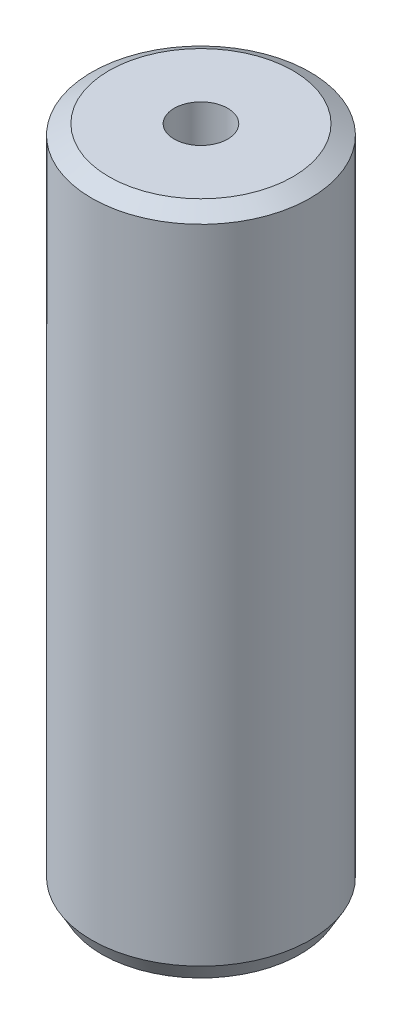
ISO-10303-21;
HEADER;
FILE_DESCRIPTION(('STEP AP214'),'2;1');
FILE_NAME('part.step','',(''),(''),'','','');
FILE_SCHEMA(('AUTOMOTIVE_DESIGN { 1 0 10303 214 1 1 1 1 }'));
ENDSEC;
DATA;
#1=APPLICATION_CONTEXT('core data for automotive mechanical design processes');
#2=APPLICATION_PROTOCOL_DEFINITION('international standard','automotive_design',2000,#1);
#3=PRODUCT_CONTEXT('',#1,'mechanical');
#4=PRODUCT('Part','Part','',(#3));
#5=PRODUCT_RELATED_PRODUCT_CATEGORY('part','',(#4));
#6=PRODUCT_DEFINITION_FORMATION('','',#4);
#7=PRODUCT_DEFINITION_CONTEXT('part definition',#1,'design');
#8=PRODUCT_DEFINITION('design','',#6,#7);
#9=PRODUCT_DEFINITION_SHAPE('','',#8);
#10=(LENGTH_UNIT() NAMED_UNIT(*) SI_UNIT(.MILLI.,.METRE.));
#11=(NAMED_UNIT(*) PLANE_ANGLE_UNIT() SI_UNIT($,.RADIAN.));
#12=(NAMED_UNIT(*) SI_UNIT($,.STERADIAN.) SOLID_ANGLE_UNIT());
#13=UNCERTAINTY_MEASURE_WITH_UNIT(LENGTH_MEASURE(1.E-05),#10,'distance_accuracy_value','');
#14=(GEOMETRIC_REPRESENTATION_CONTEXT(3) GLOBAL_UNCERTAINTY_ASSIGNED_CONTEXT((#13)) GLOBAL_UNIT_ASSIGNED_CONTEXT((#10,
#11,#12)) REPRESENTATION_CONTEXT('',''));
#15=CARTESIAN_POINT('',(0.,0.,0.));
#16=DIRECTION('',(0.,0.,1.));
#17=DIRECTION('',(1.,0.,0.));
#18=AXIS2_PLACEMENT_3D('',#15,#16,#17);
#19=CARTESIAN_POINT('',(0.,61.3127897637409,0.));
#20=DIRECTION('',(0.,-1.,0.));
#21=DIRECTION('',(0.,0.,-1.));
#22=AXIS2_PLACEMENT_3D('',#19,#20,#21);
#23=CYLINDRICAL_SURFACE('',#22,10.);
#24=CARTESIAN_POINT('',(0.,60.4016486085003,0.));
#25=DIRECTION('',(0.,1.,0.));
#26=DIRECTION('',(0.,0.,1.));
#27=AXIS2_PLACEMENT_3D('',#24,#25,#26);
#28=CIRCLE('',#27,10.);
#29=CARTESIAN_POINT('',(0.,60.4016486085003,10.));
#30=VERTEX_POINT('',#29);
#31=EDGE_CURVE('E50',#30,#30,#28,.F.);
#32=ORIENTED_EDGE('',*,*,#31,.T.);
#33=EDGE_LOOP('',(#32));
#34=FACE_BOUND('',#33,.T.);
#35=CARTESIAN_POINT('',(0.,1.57814277374357,0.));
#36=DIRECTION('',(0.,1.,0.));
#37=DIRECTION('',(0.,0.,1.));
#38=AXIS2_PLACEMENT_3D('',#35,#36,#37);
#39=CIRCLE('',#38,10.);
#40=CARTESIAN_POINT('',(0.,1.57814277374357,10.));
#41=VERTEX_POINT('',#40);
#42=EDGE_CURVE('E51',#41,#41,#39,.T.);
#43=ORIENTED_EDGE('',*,*,#42,.T.);
#44=EDGE_LOOP('',(#43));
#45=FACE_BOUND('',#44,.T.);
#46=ADVANCED_FACE('F39',(#34,#45),#23,.T.);
#47=CARTESIAN_POINT('',(0.,61.3127897637409,0.));
#48=DIRECTION('',(0.,1.,0.));
#49=DIRECTION('',(0.,0.,1.));
#50=AXIS2_PLACEMENT_3D('',#47,#48,#49);
#51=PLANE('',#50);
#52=CARTESIAN_POINT('',(0.,61.3127897637409,0.));
#53=DIRECTION('',(0.,1.,0.));
#54=DIRECTION('',(0.,0.,1.));
#55=AXIS2_PLACEMENT_3D('',#52,#53,#54);
#56=CIRCLE('',#55,8.42185722625644);
#57=CARTESIAN_POINT('',(0.,61.3127897637409,8.42185722625644));
#58=VERTEX_POINT('',#57);
#59=EDGE_CURVE('E54',#58,#58,#56,.T.);
#60=ORIENTED_EDGE('',*,*,#59,.T.);
#61=EDGE_LOOP('',(#60));
#62=FACE_BOUND('',#61,.T.);
#63=CARTESIAN_POINT('',(0.,61.3127897637409,0.));
#64=DIRECTION('',(0.,1.,0.));
#65=DIRECTION('',(0.,0.,1.));
#66=AXIS2_PLACEMENT_3D('',#63,#64,#65);
#67=CIRCLE('',#66,2.44953716285997);
#68=CARTESIAN_POINT('',(0.,61.3127897637409,2.44953716285997));
#69=VERTEX_POINT('',#68);
#70=EDGE_CURVE('E58',#69,#69,#67,.T.);
#71=ORIENTED_EDGE('',*,*,#70,.F.);
#72=EDGE_LOOP('',(#71));
#73=FACE_BOUND('',#72,.T.);
#74=ADVANCED_FACE('F69',(#62,#73),#51,.T.);
#75=CARTESIAN_POINT('',(0.,0.,0.));
#76=DIRECTION('',(0.,1.,0.));
#77=DIRECTION('',(0.,0.,1.));
#78=AXIS2_PLACEMENT_3D('',#75,#76,#77);
#79=PLANE('',#78);
#80=CARTESIAN_POINT('',(0.,0.,0.));
#81=DIRECTION('',(0.,1.,0.));
#82=DIRECTION('',(0.,0.,1.));
#83=AXIS2_PLACEMENT_3D('',#80,#81,#82);
#84=CIRCLE('',#83,9.08885884475948);
#85=CARTESIAN_POINT('',(0.,0.,9.08885884475948));
#86=VERTEX_POINT('',#85);
#87=EDGE_CURVE('E10',#86,#86,#84,.F.);
#88=ORIENTED_EDGE('',*,*,#87,.T.);
#89=EDGE_LOOP('',(#88));
#90=FACE_BOUND('',#89,.T.);
#91=CARTESIAN_POINT('',(0.,0.,0.));
#92=DIRECTION('',(0.,1.,0.));
#93=DIRECTION('',(0.,0.,1.));
#94=AXIS2_PLACEMENT_3D('',#91,#92,#93);
#95=CIRCLE('',#94,2.44953716285997);
#96=CARTESIAN_POINT('',(0.,0.,2.44953716285997));
#97=VERTEX_POINT('',#96);
#98=EDGE_CURVE('E63',#97,#97,#95,.T.);
#99=ORIENTED_EDGE('',*,*,#98,.T.);
#100=EDGE_LOOP('',(#99));
#101=FACE_BOUND('',#100,.T.);
#102=ADVANCED_FACE('F75',(#90,#101),#79,.F.);
#103=CARTESIAN_POINT('',(0.,61.3127897637409,0.));
#104=DIRECTION('',(0.,-1.,0.));
#105=DIRECTION('',(0.,0.,-1.));
#106=AXIS2_PLACEMENT_3D('',#103,#104,#105);
#107=CYLINDRICAL_SURFACE('',#106,2.44953716285997);
#108=ORIENTED_EDGE('',*,*,#70,.T.);
#109=EDGE_LOOP('',(#108));
#110=FACE_BOUND('',#109,.T.);
#111=ORIENTED_EDGE('',*,*,#98,.F.);
#112=EDGE_LOOP('',(#111));
#113=FACE_BOUND('',#112,.T.);
#114=ADVANCED_FACE('F70',(#110,#113),#107,.F.);
#115=CARTESIAN_POINT('',(0.,61.3127897637409,0.));
#116=DIRECTION('',(0.,-1.,0.));
#117=DIRECTION('',(0.,0.,-1.));
#118=AXIS2_PLACEMENT_3D('',#115,#116,#117);
#119=CONICAL_SURFACE('',#118,8.42185722625644,1.04719755119659);
#120=ORIENTED_EDGE('',*,*,#31,.F.);
#121=EDGE_LOOP('',(#120));
#122=FACE_BOUND('',#121,.T.);
#123=ORIENTED_EDGE('',*,*,#59,.F.);
#124=EDGE_LOOP('',(#123));
#125=FACE_BOUND('',#124,.T.);
#126=ADVANCED_FACE('F81',(#122,#125),#119,.T.);
#127=CARTESIAN_POINT('',(0.,1.57814277374357,0.));
#128=DIRECTION('',(0.,1.,0.));
#129=DIRECTION('',(0.,0.,1.));
#130=AXIS2_PLACEMENT_3D('',#127,#128,#129);
#131=CONICAL_SURFACE('',#130,10.,0.523598775598303);
#132=ORIENTED_EDGE('',*,*,#87,.F.);
#133=EDGE_LOOP('',(#132));
#134=FACE_BOUND('',#133,.T.);
#135=ORIENTED_EDGE('',*,*,#42,.F.);
#136=EDGE_LOOP('',(#135));
#137=FACE_BOUND('',#136,.T.);
#138=ADVANCED_FACE('F45',(#134,#137),#131,.T.);
#139=CLOSED_SHELL('',(#46,#74,#102,#114,#126,#138));
#140=MANIFOLD_SOLID_BREP('B2',#139);
#141=ADVANCED_BREP_SHAPE_REPRESENTATION('',(#18,#140),#14);
#142=SHAPE_DEFINITION_REPRESENTATION(#9,#141);
ENDSEC;
END-ISO-10303-21;
